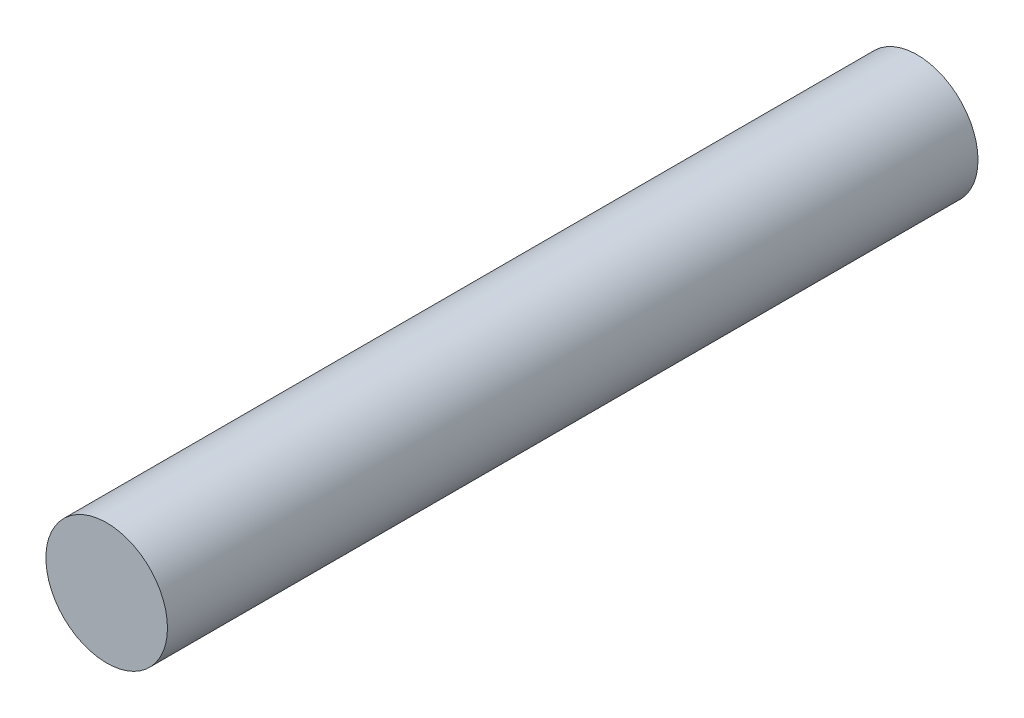
ISO-10303-21;
HEADER;
FILE_DESCRIPTION(('STEP AP214'),'2;1');
FILE_NAME('part.step','',(''),(''),'','','');
FILE_SCHEMA(('AUTOMOTIVE_DESIGN { 1 0 10303 214 1 1 1 1 }'));
ENDSEC;
DATA;
#1=APPLICATION_CONTEXT('core data for automotive mechanical design processes');
#2=APPLICATION_PROTOCOL_DEFINITION('international standard','automotive_design',2000,#1);
#3=PRODUCT_CONTEXT('',#1,'mechanical');
#4=PRODUCT('Part','Part','',(#3));
#5=PRODUCT_RELATED_PRODUCT_CATEGORY('part','',(#4));
#6=PRODUCT_DEFINITION_FORMATION('','',#4);
#7=PRODUCT_DEFINITION_CONTEXT('part definition',#1,'design');
#8=PRODUCT_DEFINITION('design','',#6,#7);
#9=PRODUCT_DEFINITION_SHAPE('','',#8);
#10=(LENGTH_UNIT() NAMED_UNIT(*) SI_UNIT(.MILLI.,.METRE.));
#11=(NAMED_UNIT(*) PLANE_ANGLE_UNIT() SI_UNIT($,.RADIAN.));
#12=(NAMED_UNIT(*) SI_UNIT($,.STERADIAN.) SOLID_ANGLE_UNIT());
#13=UNCERTAINTY_MEASURE_WITH_UNIT(LENGTH_MEASURE(1.E-05),#10,'distance_accuracy_value','');
#14=(GEOMETRIC_REPRESENTATION_CONTEXT(3) GLOBAL_UNCERTAINTY_ASSIGNED_CONTEXT((#13)) GLOBAL_UNIT_ASSIGNED_CONTEXT((#10,
#11,#12)) REPRESENTATION_CONTEXT('',''));
#15=CARTESIAN_POINT('',(0.,0.,0.));
#16=DIRECTION('',(0.,0.,1.));
#17=DIRECTION('',(1.,0.,0.));
#18=AXIS2_PLACEMENT_3D('',#15,#16,#17);
#19=CARTESIAN_POINT('',(0.,0.,20.));
#20=DIRECTION('',(0.,0.,-1.));
#21=DIRECTION('',(-1.,0.,0.));
#22=AXIS2_PLACEMENT_3D('',#19,#20,#21);
#23=CYLINDRICAL_SURFACE('',#22,1.5);
#24=CARTESIAN_POINT('',(0.,0.,20.));
#25=DIRECTION('',(0.,0.,1.));
#26=DIRECTION('',(1.,0.,0.));
#27=AXIS2_PLACEMENT_3D('',#24,#25,#26);
#28=CIRCLE('',#27,1.5);
#29=CARTESIAN_POINT('',(1.5,0.,20.));
#30=VERTEX_POINT('',#29);
#31=EDGE_CURVE('E10',#30,#30,#28,.T.);
#32=ORIENTED_EDGE('',*,*,#31,.F.);
#33=EDGE_LOOP('',(#32));
#34=FACE_BOUND('',#33,.T.);
#35=CARTESIAN_POINT('',(0.,0.,0.));
#36=DIRECTION('',(0.,0.,1.));
#37=DIRECTION('',(1.,0.,0.));
#38=AXIS2_PLACEMENT_3D('',#35,#36,#37);
#39=CIRCLE('',#38,1.5);
#40=CARTESIAN_POINT('',(1.5,0.,0.));
#41=VERTEX_POINT('',#40);
#42=EDGE_CURVE('E44',#41,#41,#39,.T.);
#43=ORIENTED_EDGE('',*,*,#42,.T.);
#44=EDGE_LOOP('',(#43));
#45=FACE_BOUND('',#44,.T.);
#46=ADVANCED_FACE('F41',(#34,#45),#23,.T.);
#47=CARTESIAN_POINT('',(0.,0.,20.));
#48=DIRECTION('',(0.,0.,1.));
#49=DIRECTION('',(1.,0.,0.));
#50=AXIS2_PLACEMENT_3D('',#47,#48,#49);
#51=PLANE('',#50);
#52=ORIENTED_EDGE('',*,*,#31,.T.);
#53=EDGE_LOOP('',(#52));
#54=FACE_BOUND('',#53,.T.);
#55=ADVANCED_FACE('F58',(#54),#51,.T.);
#56=CARTESIAN_POINT('',(0.,0.,0.));
#57=DIRECTION('',(0.,0.,1.));
#58=DIRECTION('',(1.,0.,0.));
#59=AXIS2_PLACEMENT_3D('',#56,#57,#58);
#60=PLANE('',#59);
#61=ORIENTED_EDGE('',*,*,#42,.F.);
#62=EDGE_LOOP('',(#61));
#63=FACE_BOUND('',#62,.T.);
#64=ADVANCED_FACE('F56',(#63),#60,.F.);
#65=CLOSED_SHELL('',(#46,#55,#64));
#66=MANIFOLD_SOLID_BREP('B2',#65);
#67=ADVANCED_BREP_SHAPE_REPRESENTATION('',(#18,#66),#14);
#68=SHAPE_DEFINITION_REPRESENTATION(#9,#67);
ENDSEC;
END-ISO-10303-21;
